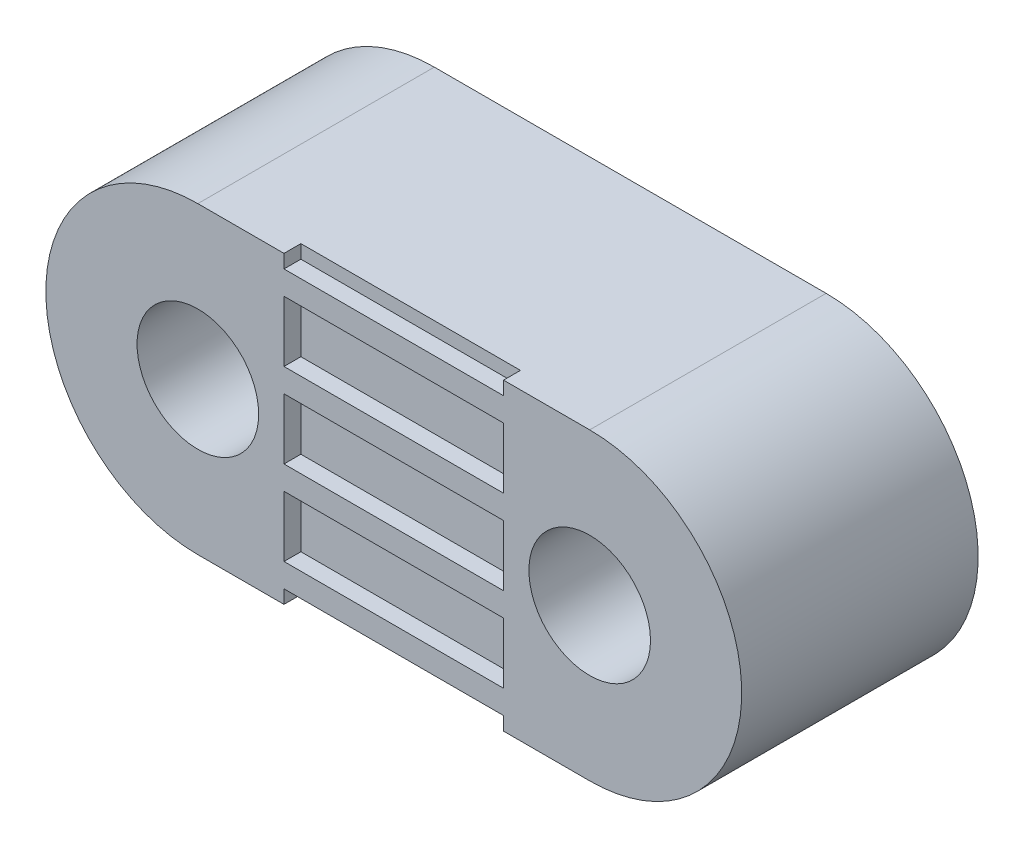
ISO-10303-21;
HEADER;
FILE_DESCRIPTION(('STEP AP214'),'2;1');
FILE_NAME('part.step','',(''),(''),'','','');
FILE_SCHEMA(('AUTOMOTIVE_DESIGN { 1 0 10303 214 1 1 1 1 }'));
ENDSEC;
DATA;
#1=APPLICATION_CONTEXT('core data for automotive mechanical design processes');
#2=APPLICATION_PROTOCOL_DEFINITION('international standard','automotive_design',2000,#1);
#3=PRODUCT_CONTEXT('',#1,'mechanical');
#4=PRODUCT('Part','Part','',(#3));
#5=PRODUCT_RELATED_PRODUCT_CATEGORY('part','',(#4));
#6=PRODUCT_DEFINITION_FORMATION('','',#4);
#7=PRODUCT_DEFINITION_CONTEXT('part definition',#1,'design');
#8=PRODUCT_DEFINITION('design','',#6,#7);
#9=PRODUCT_DEFINITION_SHAPE('','',#8);
#10=(LENGTH_UNIT() NAMED_UNIT(*) SI_UNIT(.MILLI.,.METRE.));
#11=(NAMED_UNIT(*) PLANE_ANGLE_UNIT() SI_UNIT($,.RADIAN.));
#12=(NAMED_UNIT(*) SI_UNIT($,.STERADIAN.) SOLID_ANGLE_UNIT());
#13=UNCERTAINTY_MEASURE_WITH_UNIT(LENGTH_MEASURE(1.E-05),#10,'distance_accuracy_value','');
#14=(GEOMETRIC_REPRESENTATION_CONTEXT(3) GLOBAL_UNCERTAINTY_ASSIGNED_CONTEXT((#13)) GLOBAL_UNIT_ASSIGNED_CONTEXT((#10,
#11,#12)) REPRESENTATION_CONTEXT('',''));
#15=CARTESIAN_POINT('',(0.,0.,0.));
#16=DIRECTION('',(0.,0.,1.));
#17=DIRECTION('',(1.,0.,0.));
#18=AXIS2_PLACEMENT_3D('',#15,#16,#17);
#19=CARTESIAN_POINT('',(9.,-0.500000000000001,-7.));
#20=DIRECTION('',(0.,0.,1.));
#21=DIRECTION('',(1.,0.,0.));
#22=AXIS2_PLACEMENT_3D('',#19,#20,#21);
#23=CYLINDRICAL_SURFACE('',#22,4.5);
#24=CARTESIAN_POINT('',(9.,-0.500000000000001,0.));
#25=DIRECTION('',(0.,0.,1.));
#26=DIRECTION('',(1.,0.,0.));
#27=AXIS2_PLACEMENT_3D('',#24,#25,#26);
#28=CIRCLE('',#27,4.5);
#29=CARTESIAN_POINT('',(9.,-5.,0.));
#30=VERTEX_POINT('',#29);
#31=CARTESIAN_POINT('',(9.,4.,0.));
#32=VERTEX_POINT('',#31);
#33=EDGE_CURVE('E349',#30,#32,#28,.T.);
#34=ORIENTED_EDGE('',*,*,#33,.F.);
#35=DIRECTION('',(0.,0.,1.));
#36=VECTOR('',#35,1.);
#37=CARTESIAN_POINT('',(9.,-5.,-7.));
#38=LINE('',#37,#36);
#39=CARTESIAN_POINT('',(9.,-5.,-7.));
#40=VERTEX_POINT('',#39);
#41=EDGE_CURVE('E378',#40,#30,#38,.T.);
#42=ORIENTED_EDGE('',*,*,#41,.F.);
#43=CARTESIAN_POINT('',(9.,-0.500000000000001,-7.));
#44=DIRECTION('',(0.,0.,1.));
#45=DIRECTION('',(1.,0.,0.));
#46=AXIS2_PLACEMENT_3D('',#43,#44,#45);
#47=CIRCLE('',#46,4.5);
#48=CARTESIAN_POINT('',(9.,4.,-7.));
#49=VERTEX_POINT('',#48);
#50=EDGE_CURVE('E352',#40,#49,#47,.T.);
#51=ORIENTED_EDGE('',*,*,#50,.T.);
#52=DIRECTION('',(0.,0.,1.));
#53=VECTOR('',#52,1.);
#54=CARTESIAN_POINT('',(9.,4.,-7.));
#55=LINE('',#54,#53);
#56=EDGE_CURVE('E365',#49,#32,#55,.T.);
#57=ORIENTED_EDGE('',*,*,#56,.T.);
#58=EDGE_LOOP('',(#34,#42,#51,#57));
#59=FACE_BOUND('',#58,.T.);
#60=ADVANCED_FACE('F34',(#59),#23,.T.);
#61=CARTESIAN_POINT('',(-2.6,-5.,-7.));
#62=DIRECTION('',(0.,-1.,0.));
#63=DIRECTION('',(0.,0.,-1.));
#64=AXIS2_PLACEMENT_3D('',#61,#62,#63);
#65=PLANE('',#64);
#66=DIRECTION('',(0.,0.,-1.));
#67=VECTOR('',#66,1.);
#68=CARTESIAN_POINT('',(-0.049999865110938,-5.,-7.));
#69=LINE('',#68,#67);
#70=CARTESIAN_POINT('',(-0.0499998651109379,-5.,0.));
#71=VERTEX_POINT('',#70);
#72=CARTESIAN_POINT('',(-0.0499998651109379,-5.,-0.5));
#73=VERTEX_POINT('',#72);
#74=EDGE_CURVE('E337',#71,#73,#69,.T.);
#75=ORIENTED_EDGE('',*,*,#74,.F.);
#76=DIRECTION('',(1.,0.,0.));
#77=VECTOR('',#76,1.);
#78=CARTESIAN_POINT('',(-2.6,-5.,0.));
#79=LINE('',#78,#77);
#80=CARTESIAN_POINT('',(-2.6,-5.,0.));
#81=VERTEX_POINT('',#80);
#82=EDGE_CURVE('E356',#81,#71,#79,.T.);
#83=ORIENTED_EDGE('',*,*,#82,.F.);
#84=DIRECTION('',(0.,0.,1.));
#85=VECTOR('',#84,1.);
#86=CARTESIAN_POINT('',(-2.6,-5.,-7.));
#87=LINE('',#86,#85);
#88=CARTESIAN_POINT('',(-2.6,-5.,-7.));
#89=VERTEX_POINT('',#88);
#90=EDGE_CURVE('E382',#89,#81,#87,.T.);
#91=ORIENTED_EDGE('',*,*,#90,.F.);
#92=DIRECTION('',(1.,0.,0.));
#93=VECTOR('',#92,1.);
#94=CARTESIAN_POINT('',(-2.6,-5.,-7.));
#95=LINE('',#94,#93);
#96=EDGE_CURVE('E362',#89,#40,#95,.T.);
#97=ORIENTED_EDGE('',*,*,#96,.T.);
#98=ORIENTED_EDGE('',*,*,#41,.T.);
#99=CARTESIAN_POINT('',(6.45000013488906,-5.,0.));
#100=VERTEX_POINT('',#99);
#101=EDGE_CURVE('E375',#100,#30,#79,.T.);
#102=ORIENTED_EDGE('',*,*,#101,.F.);
#103=DIRECTION('',(0.,0.,1.));
#104=VECTOR('',#103,1.);
#105=CARTESIAN_POINT('',(6.45000013488906,-5.,-7.));
#106=LINE('',#105,#104);
#107=CARTESIAN_POINT('',(6.45000013488906,-5.,-0.5));
#108=VERTEX_POINT('',#107);
#109=EDGE_CURVE('E333',#108,#100,#106,.T.);
#110=ORIENTED_EDGE('',*,*,#109,.F.);
#111=DIRECTION('',(-1.,0.,0.));
#112=VECTOR('',#111,1.);
#113=CARTESIAN_POINT('',(-2.6,-5.,-0.5));
#114=LINE('',#113,#112);
#115=EDGE_CURVE('E389',#108,#73,#114,.T.);
#116=ORIENTED_EDGE('',*,*,#115,.T.);
#117=EDGE_LOOP('',(#75,#83,#91,#97,#98,#102,#110,#116));
#118=FACE_BOUND('',#117,.T.);
#119=ADVANCED_FACE('F394',(#118),#65,.T.);
#120=CARTESIAN_POINT('',(-2.6,-0.500000000000001,-7.));
#121=DIRECTION('',(0.,0.,1.));
#122=DIRECTION('',(1.,0.,0.));
#123=AXIS2_PLACEMENT_3D('',#120,#121,#122);
#124=CYLINDRICAL_SURFACE('',#123,4.5);
#125=CARTESIAN_POINT('',(-2.6,-0.500000000000001,0.));
#126=DIRECTION('',(0.,0.,1.));
#127=DIRECTION('',(1.,0.,0.));
#128=AXIS2_PLACEMENT_3D('',#125,#126,#127);
#129=CIRCLE('',#128,4.5);
#130=CARTESIAN_POINT('',(-2.6,4.,0.));
#131=VERTEX_POINT('',#130);
#132=EDGE_CURVE('E372',#131,#81,#129,.T.);
#133=ORIENTED_EDGE('',*,*,#132,.F.);
#134=DIRECTION('',(0.,0.,1.));
#135=VECTOR('',#134,1.);
#136=CARTESIAN_POINT('',(-2.6,4.,-7.));
#137=LINE('',#136,#135);
#138=CARTESIAN_POINT('',(-2.6,4.,-7.));
#139=VERTEX_POINT('',#138);
#140=EDGE_CURVE('E384',#139,#131,#137,.T.);
#141=ORIENTED_EDGE('',*,*,#140,.F.);
#142=CARTESIAN_POINT('',(-2.6,-0.500000000000001,-7.));
#143=DIRECTION('',(0.,0.,1.));
#144=DIRECTION('',(1.,0.,0.));
#145=AXIS2_PLACEMENT_3D('',#142,#143,#144);
#146=CIRCLE('',#145,4.5);
#147=EDGE_CURVE('E359',#139,#89,#146,.T.);
#148=ORIENTED_EDGE('',*,*,#147,.T.);
#149=ORIENTED_EDGE('',*,*,#90,.T.);
#150=EDGE_LOOP('',(#133,#141,#148,#149));
#151=FACE_BOUND('',#150,.T.);
#152=ADVANCED_FACE('F419',(#151),#124,.T.);
#153=CARTESIAN_POINT('',(9.,4.,-7.));
#154=DIRECTION('',(0.,1.,0.));
#155=DIRECTION('',(-1.,0.,0.));
#156=AXIS2_PLACEMENT_3D('',#153,#154,#155);
#157=PLANE('',#156);
#158=DIRECTION('',(0.,0.,1.));
#159=VECTOR('',#158,1.);
#160=CARTESIAN_POINT('',(-0.0499998651109362,4.,-7.));
#161=LINE('',#160,#159);
#162=CARTESIAN_POINT('',(-0.0499998651109373,4.,-0.5));
#163=VERTEX_POINT('',#162);
#164=CARTESIAN_POINT('',(-0.0499998651109373,4.,0.));
#165=VERTEX_POINT('',#164);
#166=EDGE_CURVE('E221',#163,#165,#161,.T.);
#167=ORIENTED_EDGE('',*,*,#166,.F.);
#168=DIRECTION('',(1.,0.,0.));
#169=VECTOR('',#168,1.);
#170=CARTESIAN_POINT('',(9.,4.,-0.5));
#171=LINE('',#170,#169);
#172=CARTESIAN_POINT('',(6.45000013488906,4.,-0.5));
#173=VERTEX_POINT('',#172);
#174=EDGE_CURVE('E11',#163,#173,#171,.T.);
#175=ORIENTED_EDGE('',*,*,#174,.T.);
#176=DIRECTION('',(0.,0.,-1.));
#177=VECTOR('',#176,1.);
#178=CARTESIAN_POINT('',(6.45000013488906,4.,-7.));
#179=LINE('',#178,#177);
#180=CARTESIAN_POINT('',(6.45000013488906,4.,0.));
#181=VERTEX_POINT('',#180);
#182=EDGE_CURVE('E218',#181,#173,#179,.T.);
#183=ORIENTED_EDGE('',*,*,#182,.F.);
#184=DIRECTION('',(-1.,0.,0.));
#185=VECTOR('',#184,1.);
#186=CARTESIAN_POINT('',(9.,4.,0.));
#187=LINE('',#186,#185);
#188=EDGE_CURVE('E369',#32,#181,#187,.T.);
#189=ORIENTED_EDGE('',*,*,#188,.F.);
#190=ORIENTED_EDGE('',*,*,#56,.F.);
#191=DIRECTION('',(-1.,0.,0.));
#192=VECTOR('',#191,1.);
#193=CARTESIAN_POINT('',(9.,4.,-7.));
#194=LINE('',#193,#192);
#195=EDGE_CURVE('E355',#49,#139,#194,.T.);
#196=ORIENTED_EDGE('',*,*,#195,.T.);
#197=ORIENTED_EDGE('',*,*,#140,.T.);
#198=EDGE_CURVE('E368',#165,#131,#187,.T.);
#199=ORIENTED_EDGE('',*,*,#198,.F.);
#200=EDGE_LOOP('',(#167,#175,#183,#189,#190,#196,#197,#199));
#201=FACE_BOUND('',#200,.T.);
#202=ADVANCED_FACE('F430',(#201),#157,.T.);
#203=CARTESIAN_POINT('',(9.,-0.500000000000001,-7.));
#204=DIRECTION('',(0.,0.,1.));
#205=DIRECTION('',(1.,0.,0.));
#206=AXIS2_PLACEMENT_3D('',#203,#204,#205);
#207=PLANE('',#206);
#208=CARTESIAN_POINT('',(-2.6,-0.500000000000001,-7.));
#209=DIRECTION('',(0.,0.,1.));
#210=DIRECTION('',(1.,0.,0.));
#211=AXIS2_PLACEMENT_3D('',#208,#209,#210);
#212=CIRCLE('',#211,1.8);
#213=CARTESIAN_POINT('',(-0.799999999999995,-0.500000000000001,-7.));
#214=VERTEX_POINT('',#213);
#215=EDGE_CURVE('E340',#214,#214,#212,.T.);
#216=ORIENTED_EDGE('',*,*,#215,.T.);
#217=EDGE_LOOP('',(#216));
#218=FACE_BOUND('',#217,.T.);
#219=CARTESIAN_POINT('',(9.,-0.500000000000001,-7.));
#220=DIRECTION('',(0.,0.,1.));
#221=DIRECTION('',(1.,0.,0.));
#222=AXIS2_PLACEMENT_3D('',#219,#220,#221);
#223=CIRCLE('',#222,1.79999986511117);
#224=CARTESIAN_POINT('',(10.7999998651112,-0.500000000000001,-7.));
#225=VERTEX_POINT('',#224);
#226=EDGE_CURVE('E346',#225,#225,#223,.T.);
#227=ORIENTED_EDGE('',*,*,#226,.T.);
#228=EDGE_LOOP('',(#227));
#229=FACE_BOUND('',#228,.T.);
#230=ORIENTED_EDGE('',*,*,#50,.F.);
#231=ORIENTED_EDGE('',*,*,#96,.F.);
#232=ORIENTED_EDGE('',*,*,#147,.F.);
#233=ORIENTED_EDGE('',*,*,#195,.F.);
#234=EDGE_LOOP('',(#230,#231,#232,#233));
#235=FACE_BOUND('',#234,.T.);
#236=ADVANCED_FACE('F423',(#218,#229,#235),#207,.F.);
#237=CARTESIAN_POINT('',(9.,-0.500000000000001,0.));
#238=DIRECTION('',(0.,0.,1.));
#239=DIRECTION('',(1.,0.,0.));
#240=AXIS2_PLACEMENT_3D('',#237,#238,#239);
#241=PLANE('',#240);
#242=DIRECTION('',(0.,-1.,0.));
#243=VECTOR('',#242,1.);
#244=CARTESIAN_POINT('',(-0.0499998651109449,-0.499999999999986,0.));
#245=LINE('',#244,#243);
#246=CARTESIAN_POINT('',(-0.049999865110938,3.59999999999998,0.));
#247=VERTEX_POINT('',#246);
#248=EDGE_CURVE('E41',#165,#247,#245,.T.);
#249=ORIENTED_EDGE('',*,*,#248,.F.);
#250=ORIENTED_EDGE('',*,*,#198,.T.);
#251=ORIENTED_EDGE('',*,*,#132,.T.);
#252=ORIENTED_EDGE('',*,*,#82,.T.);
#253=DIRECTION('',(0.,-1.,0.));
#254=VECTOR('',#253,1.);
#255=CARTESIAN_POINT('',(-0.0499998651109379,-4.59999999999999,0.));
#256=LINE('',#255,#254);
#257=CARTESIAN_POINT('',(-0.0499998651109379,-4.59999999999999,0.));
#258=VERTEX_POINT('',#257);
#259=EDGE_CURVE('E311',#258,#71,#256,.T.);
#260=ORIENTED_EDGE('',*,*,#259,.F.);
#261=DIRECTION('',(-1.,0.,0.));
#262=VECTOR('',#261,1.);
#263=CARTESIAN_POINT('',(6.45000013488906,-4.59999999999999,0.));
#264=LINE('',#263,#262);
#265=CARTESIAN_POINT('',(6.45000013488906,-4.59999999999999,0.));
#266=VERTEX_POINT('',#265);
#267=EDGE_CURVE('E322',#266,#258,#264,.T.);
#268=ORIENTED_EDGE('',*,*,#267,.F.);
#269=DIRECTION('',(0.,1.,0.));
#270=VECTOR('',#269,1.);
#271=CARTESIAN_POINT('',(6.45000013488907,-0.499999999999999,0.));
#272=LINE('',#271,#270);
#273=EDGE_CURVE('E381',#100,#266,#272,.T.);
#274=ORIENTED_EDGE('',*,*,#273,.F.);
#275=ORIENTED_EDGE('',*,*,#101,.T.);
#276=ORIENTED_EDGE('',*,*,#33,.T.);
#277=ORIENTED_EDGE('',*,*,#188,.T.);
#278=DIRECTION('',(0.,1.,0.));
#279=VECTOR('',#278,1.);
#280=CARTESIAN_POINT('',(6.45000013488906,3.6,0.));
#281=LINE('',#280,#279);
#282=CARTESIAN_POINT('',(6.45000013488906,3.6,0.));
#283=VERTEX_POINT('',#282);
#284=EDGE_CURVE('E202',#283,#181,#281,.T.);
#285=ORIENTED_EDGE('',*,*,#284,.F.);
#286=DIRECTION('',(1.,0.,0.));
#287=VECTOR('',#286,1.);
#288=CARTESIAN_POINT('',(-0.049999865110938,3.59999999999998,0.));
#289=LINE('',#288,#287);
#290=EDGE_CURVE('E215',#247,#283,#289,.T.);
#291=ORIENTED_EDGE('',*,*,#290,.F.);
#292=EDGE_LOOP('',(#249,#250,#251,#252,#260,#268,#274,#275,#276,#277,#285,#291));
#293=FACE_BOUND('',#292,.T.);
#294=DIRECTION('',(1.,0.,0.));
#295=VECTOR('',#294,1.);
#296=CARTESIAN_POINT('',(-0.0499998651109376,1.10000000000001,0.));
#297=LINE('',#296,#295);
#298=CARTESIAN_POINT('',(-0.0499998651109376,1.10000000000001,0.));
#299=VERTEX_POINT('',#298);
#300=CARTESIAN_POINT('',(6.45000013488906,1.1,0.));
#301=VERTEX_POINT('',#300);
#302=EDGE_CURVE('E56',#299,#301,#297,.T.);
#303=ORIENTED_EDGE('',*,*,#302,.F.);
#304=DIRECTION('',(0.,-1.,0.));
#305=VECTOR('',#304,1.);
#306=CARTESIAN_POINT('',(-0.0499998651109369,2.9,0.));
#307=LINE('',#306,#305);
#308=CARTESIAN_POINT('',(-0.0499998651109369,2.9,0.));
#309=VERTEX_POINT('',#308);
#310=EDGE_CURVE('E227',#309,#299,#307,.T.);
#311=ORIENTED_EDGE('',*,*,#310,.F.);
#312=DIRECTION('',(-1.,0.,0.));
#313=VECTOR('',#312,1.);
#314=CARTESIAN_POINT('',(6.45000013488906,2.90000000000001,0.));
#315=LINE('',#314,#313);
#316=CARTESIAN_POINT('',(6.45000013488906,2.90000000000001,0.));
#317=VERTEX_POINT('',#316);
#318=EDGE_CURVE('E241',#317,#309,#315,.T.);
#319=ORIENTED_EDGE('',*,*,#318,.F.);
#320=DIRECTION('',(0.,1.,0.));
#321=VECTOR('',#320,1.);
#322=CARTESIAN_POINT('',(6.45000013488906,1.1,0.));
#323=LINE('',#322,#321);
#324=EDGE_CURVE('E238',#301,#317,#323,.T.);
#325=ORIENTED_EDGE('',*,*,#324,.F.);
#326=EDGE_LOOP('',(#303,#311,#319,#325));
#327=FACE_BOUND('',#326,.T.);
#328=DIRECTION('',(1.,0.,0.));
#329=VECTOR('',#328,1.);
#330=CARTESIAN_POINT('',(-0.0499998651109376,-1.39999999999999,0.));
#331=LINE('',#330,#329);
#332=CARTESIAN_POINT('',(-0.0499998651109376,-1.39999999999999,0.));
#333=VERTEX_POINT('',#332);
#334=CARTESIAN_POINT('',(6.45000013488906,-1.4,0.));
#335=VERTEX_POINT('',#334);
#336=EDGE_CURVE('E248',#333,#335,#331,.T.);
#337=ORIENTED_EDGE('',*,*,#336,.F.);
#338=DIRECTION('',(0.,-1.,0.));
#339=VECTOR('',#338,1.);
#340=CARTESIAN_POINT('',(-0.049999865110937,0.399999999999995,0.));
#341=LINE('',#340,#339);
#342=CARTESIAN_POINT('',(-0.049999865110937,0.399999999999995,0.));
#343=VERTEX_POINT('',#342);
#344=EDGE_CURVE('E258',#343,#333,#341,.T.);
#345=ORIENTED_EDGE('',*,*,#344,.F.);
#346=DIRECTION('',(-1.,0.,0.));
#347=VECTOR('',#346,1.);
#348=CARTESIAN_POINT('',(6.45000013488906,0.400000000000008,0.));
#349=LINE('',#348,#347);
#350=CARTESIAN_POINT('',(6.45000013488906,0.400000000000008,0.));
#351=VERTEX_POINT('',#350);
#352=EDGE_CURVE('E272',#351,#343,#349,.T.);
#353=ORIENTED_EDGE('',*,*,#352,.F.);
#354=DIRECTION('',(0.,1.,0.));
#355=VECTOR('',#354,1.);
#356=CARTESIAN_POINT('',(6.45000013488906,-1.4,0.));
#357=LINE('',#356,#355);
#358=EDGE_CURVE('E269',#335,#351,#357,.T.);
#359=ORIENTED_EDGE('',*,*,#358,.F.);
#360=EDGE_LOOP('',(#337,#345,#353,#359));
#361=FACE_BOUND('',#360,.T.);
#362=DIRECTION('',(1.,0.,0.));
#363=VECTOR('',#362,1.);
#364=CARTESIAN_POINT('',(-0.0499998651109379,-3.89999999999999,0.));
#365=LINE('',#364,#363);
#366=CARTESIAN_POINT('',(-0.0499998651109379,-3.89999999999999,0.));
#367=VERTEX_POINT('',#366);
#368=CARTESIAN_POINT('',(6.45000013488906,-3.89999999999999,0.));
#369=VERTEX_POINT('',#368);
#370=EDGE_CURVE('E279',#367,#369,#365,.T.);
#371=ORIENTED_EDGE('',*,*,#370,.F.);
#372=DIRECTION('',(0.,-1.,0.));
#373=VECTOR('',#372,1.);
#374=CARTESIAN_POINT('',(-0.0499998651109379,-2.09999999999999,0.));
#375=LINE('',#374,#373);
#376=CARTESIAN_POINT('',(-0.0499998651109379,-2.09999999999999,0.));
#377=VERTEX_POINT('',#376);
#378=EDGE_CURVE('E290',#377,#367,#375,.T.);
#379=ORIENTED_EDGE('',*,*,#378,.F.);
#380=DIRECTION('',(-1.,0.,0.));
#381=VECTOR('',#380,1.);
#382=CARTESIAN_POINT('',(6.45000013488906,-2.09999999999999,0.));
#383=LINE('',#382,#381);
#384=CARTESIAN_POINT('',(6.45000013488906,-2.09999999999999,0.));
#385=VERTEX_POINT('',#384);
#386=EDGE_CURVE('E304',#385,#377,#383,.T.);
#387=ORIENTED_EDGE('',*,*,#386,.F.);
#388=DIRECTION('',(0.,1.,0.));
#389=VECTOR('',#388,1.);
#390=CARTESIAN_POINT('',(6.45000013488906,-3.89999999999999,0.));
#391=LINE('',#390,#389);
#392=EDGE_CURVE('E301',#369,#385,#391,.T.);
#393=ORIENTED_EDGE('',*,*,#392,.F.);
#394=EDGE_LOOP('',(#371,#379,#387,#393));
#395=FACE_BOUND('',#394,.T.);
#396=CARTESIAN_POINT('',(-2.6,-0.500000000000001,0.));
#397=DIRECTION('',(0.,0.,1.));
#398=DIRECTION('',(1.,0.,0.));
#399=AXIS2_PLACEMENT_3D('',#396,#397,#398);
#400=CIRCLE('',#399,1.8);
#401=CARTESIAN_POINT('',(-0.799999999999995,-0.500000000000001,0.));
#402=VERTEX_POINT('',#401);
#403=EDGE_CURVE('E339',#402,#402,#400,.T.);
#404=ORIENTED_EDGE('',*,*,#403,.F.);
#405=EDGE_LOOP('',(#404));
#406=FACE_BOUND('',#405,.T.);
#407=CARTESIAN_POINT('',(9.,-0.500000000000001,0.));
#408=DIRECTION('',(0.,0.,1.));
#409=DIRECTION('',(1.,0.,0.));
#410=AXIS2_PLACEMENT_3D('',#407,#408,#409);
#411=CIRCLE('',#410,1.79999986511117);
#412=CARTESIAN_POINT('',(10.7999998651112,-0.500000000000001,0.));
#413=VERTEX_POINT('',#412);
#414=EDGE_CURVE('E343',#413,#413,#411,.T.);
#415=ORIENTED_EDGE('',*,*,#414,.F.);
#416=EDGE_LOOP('',(#415));
#417=FACE_BOUND('',#416,.T.);
#418=ADVANCED_FACE('F413',(#293,#327,#361,#395,#406,#417),#241,.T.);
#419=CARTESIAN_POINT('',(9.,-0.500000000000001,-7.));
#420=DIRECTION('',(0.,0.,1.));
#421=DIRECTION('',(1.,0.,0.));
#422=AXIS2_PLACEMENT_3D('',#419,#420,#421);
#423=CYLINDRICAL_SURFACE('',#422,1.79999986511117);
#424=ORIENTED_EDGE('',*,*,#226,.F.);
#425=EDGE_LOOP('',(#424));
#426=FACE_BOUND('',#425,.T.);
#427=ORIENTED_EDGE('',*,*,#414,.T.);
#428=EDGE_LOOP('',(#427));
#429=FACE_BOUND('',#428,.T.);
#430=ADVANCED_FACE('F463',(#426,#429),#423,.F.);
#431=CARTESIAN_POINT('',(-2.6,-0.500000000000001,-7.));
#432=DIRECTION('',(0.,0.,1.));
#433=DIRECTION('',(1.,0.,0.));
#434=AXIS2_PLACEMENT_3D('',#431,#432,#433);
#435=CYLINDRICAL_SURFACE('',#434,1.8);
#436=ORIENTED_EDGE('',*,*,#215,.F.);
#437=EDGE_LOOP('',(#436));
#438=FACE_BOUND('',#437,.T.);
#439=ORIENTED_EDGE('',*,*,#403,.T.);
#440=EDGE_LOOP('',(#439));
#441=FACE_BOUND('',#440,.T.);
#442=ADVANCED_FACE('F468',(#438,#441),#435,.F.);
#443=CARTESIAN_POINT('',(-0.0499998651109379,-4.59999999999999,-0.5));
#444=DIRECTION('',(-1.,0.,0.));
#445=DIRECTION('',(0.,-1.,0.));
#446=AXIS2_PLACEMENT_3D('',#443,#444,#445);
#447=PLANE('',#446);
#448=ORIENTED_EDGE('',*,*,#74,.T.);
#449=DIRECTION('',(0.,-1.,0.));
#450=VECTOR('',#449,1.);
#451=CARTESIAN_POINT('',(-0.0499998651109379,-4.59999999999999,-0.5));
#452=LINE('',#451,#450);
#453=CARTESIAN_POINT('',(-0.0499998651109379,-4.59999999999999,-0.5));
#454=VERTEX_POINT('',#453);
#455=EDGE_CURVE('E318',#454,#73,#452,.T.);
#456=ORIENTED_EDGE('',*,*,#455,.F.);
#457=DIRECTION('',(0.,0.,1.));
#458=VECTOR('',#457,1.);
#459=CARTESIAN_POINT('',(-0.0499998651109379,-4.59999999999999,-0.5));
#460=LINE('',#459,#458);
#461=EDGE_CURVE('E331',#454,#258,#460,.T.);
#462=ORIENTED_EDGE('',*,*,#461,.T.);
#463=ORIENTED_EDGE('',*,*,#259,.T.);
#464=EDGE_LOOP('',(#448,#456,#462,#463));
#465=FACE_BOUND('',#464,.T.);
#466=ADVANCED_FACE('F411',(#465),#447,.F.);
#467=CARTESIAN_POINT('',(6.45000013488906,-4.59999999999999,-0.5));
#468=DIRECTION('',(0.,1.,0.));
#469=DIRECTION('',(0.,0.,1.));
#470=AXIS2_PLACEMENT_3D('',#467,#468,#469);
#471=PLANE('',#470);
#472=ORIENTED_EDGE('',*,*,#267,.T.);
#473=ORIENTED_EDGE('',*,*,#461,.F.);
#474=DIRECTION('',(-1.,0.,0.));
#475=VECTOR('',#474,1.);
#476=CARTESIAN_POINT('',(6.45000013488906,-4.59999999999999,-0.5));
#477=LINE('',#476,#475);
#478=CARTESIAN_POINT('',(6.45000013488906,-4.59999999999999,-0.5));
#479=VERTEX_POINT('',#478);
#480=EDGE_CURVE('E324',#479,#454,#477,.T.);
#481=ORIENTED_EDGE('',*,*,#480,.F.);
#482=DIRECTION('',(0.,0.,1.));
#483=VECTOR('',#482,1.);
#484=CARTESIAN_POINT('',(6.45000013488906,-4.59999999999999,-0.5));
#485=LINE('',#484,#483);
#486=EDGE_CURVE('E327',#479,#266,#485,.T.);
#487=ORIENTED_EDGE('',*,*,#486,.T.);
#488=EDGE_LOOP('',(#472,#473,#481,#487));
#489=FACE_BOUND('',#488,.T.);
#490=ADVANCED_FACE('F408',(#489),#471,.F.);
#491=CARTESIAN_POINT('',(6.45000013488906,-5.5,-0.5));
#492=DIRECTION('',(1.,0.,0.));
#493=DIRECTION('',(0.,1.,0.));
#494=AXIS2_PLACEMENT_3D('',#491,#492,#493);
#495=PLANE('',#494);
#496=ORIENTED_EDGE('',*,*,#109,.T.);
#497=ORIENTED_EDGE('',*,*,#273,.T.);
#498=ORIENTED_EDGE('',*,*,#486,.F.);
#499=DIRECTION('',(0.,1.,0.));
#500=VECTOR('',#499,1.);
#501=CARTESIAN_POINT('',(6.45000013488906,-5.5,-0.5));
#502=LINE('',#501,#500);
#503=EDGE_CURVE('E321',#108,#479,#502,.T.);
#504=ORIENTED_EDGE('',*,*,#503,.F.);
#505=EDGE_LOOP('',(#496,#497,#498,#504));
#506=FACE_BOUND('',#505,.T.);
#507=ADVANCED_FACE('F403',(#506),#495,.F.);
#508=CARTESIAN_POINT('',(0.,0.,-0.5));
#509=DIRECTION('',(0.,0.,1.));
#510=DIRECTION('',(1.,0.,0.));
#511=AXIS2_PLACEMENT_3D('',#508,#509,#510);
#512=PLANE('',#511);
#513=ORIENTED_EDGE('',*,*,#503,.T.);
#514=ORIENTED_EDGE('',*,*,#480,.T.);
#515=ORIENTED_EDGE('',*,*,#455,.T.);
#516=ORIENTED_EDGE('',*,*,#115,.F.);
#517=EDGE_LOOP('',(#513,#514,#515,#516));
#518=FACE_BOUND('',#517,.T.);
#519=ADVANCED_FACE('F399',(#518),#512,.T.);
#520=CARTESIAN_POINT('',(-0.0499998651109379,-3.89999999999999,-0.5));
#521=DIRECTION('',(0.,-1.,0.));
#522=DIRECTION('',(1.,0.,0.));
#523=AXIS2_PLACEMENT_3D('',#520,#521,#522);
#524=PLANE('',#523);
#525=ORIENTED_EDGE('',*,*,#370,.T.);
#526=DIRECTION('',(0.,0.,1.));
#527=VECTOR('',#526,1.);
#528=CARTESIAN_POINT('',(6.45000013488906,-3.89999999999999,-0.5));
#529=LINE('',#528,#527);
#530=CARTESIAN_POINT('',(6.45000013488906,-3.89999999999999,-0.5));
#531=VERTEX_POINT('',#530);
#532=EDGE_CURVE('E299',#531,#369,#529,.T.);
#533=ORIENTED_EDGE('',*,*,#532,.F.);
#534=DIRECTION('',(1.,0.,0.));
#535=VECTOR('',#534,1.);
#536=CARTESIAN_POINT('',(-0.0499998651109379,-3.89999999999999,-0.5));
#537=LINE('',#536,#535);
#538=CARTESIAN_POINT('',(-0.0499998651109379,-3.89999999999999,-0.5));
#539=VERTEX_POINT('',#538);
#540=EDGE_CURVE('E286',#539,#531,#537,.T.);
#541=ORIENTED_EDGE('',*,*,#540,.F.);
#542=DIRECTION('',(0.,0.,1.));
#543=VECTOR('',#542,1.);
#544=CARTESIAN_POINT('',(-0.0499998651109379,-3.89999999999999,-0.5));
#545=LINE('',#544,#543);
#546=EDGE_CURVE('E309',#539,#367,#545,.T.);
#547=ORIENTED_EDGE('',*,*,#546,.T.);
#548=EDGE_LOOP('',(#525,#533,#541,#547));
#549=FACE_BOUND('',#548,.T.);
#550=ADVANCED_FACE('F481',(#549),#524,.F.);
#551=CARTESIAN_POINT('',(-0.0499998651109379,-2.09999999999999,-0.5));
#552=DIRECTION('',(-1.,0.,0.));
#553=DIRECTION('',(0.,-1.,0.));
#554=AXIS2_PLACEMENT_3D('',#551,#552,#553);
#555=PLANE('',#554);
#556=ORIENTED_EDGE('',*,*,#378,.T.);
#557=ORIENTED_EDGE('',*,*,#546,.F.);
#558=DIRECTION('',(0.,-1.,0.));
#559=VECTOR('',#558,1.);
#560=CARTESIAN_POINT('',(-0.0499998651109379,-2.09999999999999,-0.5));
#561=LINE('',#560,#559);
#562=CARTESIAN_POINT('',(-0.0499998651109379,-2.09999999999999,-0.5));
#563=VERTEX_POINT('',#562);
#564=EDGE_CURVE('E296',#563,#539,#561,.T.);
#565=ORIENTED_EDGE('',*,*,#564,.F.);
#566=DIRECTION('',(0.,0.,1.));
#567=VECTOR('',#566,1.);
#568=CARTESIAN_POINT('',(-0.0499998651109379,-2.09999999999999,-0.5));
#569=LINE('',#568,#567);
#570=EDGE_CURVE('E312',#563,#377,#569,.T.);
#571=ORIENTED_EDGE('',*,*,#570,.T.);
#572=EDGE_LOOP('',(#556,#557,#565,#571));
#573=FACE_BOUND('',#572,.T.);
#574=ADVANCED_FACE('F484',(#573),#555,.F.);
#575=CARTESIAN_POINT('',(6.45000013488906,-2.09999999999999,-0.5));
#576=DIRECTION('',(0.,1.,0.));
#577=DIRECTION('',(0.,0.,1.));
#578=AXIS2_PLACEMENT_3D('',#575,#576,#577);
#579=PLANE('',#578);
#580=ORIENTED_EDGE('',*,*,#386,.T.);
#581=ORIENTED_EDGE('',*,*,#570,.F.);
#582=DIRECTION('',(-1.,0.,0.));
#583=VECTOR('',#582,1.);
#584=CARTESIAN_POINT('',(6.45000013488906,-2.09999999999999,-0.5));
#585=LINE('',#584,#583);
#586=CARTESIAN_POINT('',(6.45000013488906,-2.09999999999999,-0.5));
#587=VERTEX_POINT('',#586);
#588=EDGE_CURVE('E293',#587,#563,#585,.T.);
#589=ORIENTED_EDGE('',*,*,#588,.F.);
#590=DIRECTION('',(0.,0.,1.));
#591=VECTOR('',#590,1.);
#592=CARTESIAN_POINT('',(6.45000013488906,-2.09999999999999,-0.5));
#593=LINE('',#592,#591);
#594=EDGE_CURVE('E314',#587,#385,#593,.T.);
#595=ORIENTED_EDGE('',*,*,#594,.T.);
#596=EDGE_LOOP('',(#580,#581,#589,#595));
#597=FACE_BOUND('',#596,.T.);
#598=ADVANCED_FACE('F490',(#597),#579,.F.);
#599=CARTESIAN_POINT('',(6.45000013488906,-3.89999999999999,-0.5));
#600=DIRECTION('',(1.,0.,0.));
#601=DIRECTION('',(0.,1.,0.));
#602=AXIS2_PLACEMENT_3D('',#599,#600,#601);
#603=PLANE('',#602);
#604=ORIENTED_EDGE('',*,*,#392,.T.);
#605=ORIENTED_EDGE('',*,*,#594,.F.);
#606=DIRECTION('',(0.,1.,0.));
#607=VECTOR('',#606,1.);
#608=CARTESIAN_POINT('',(6.45000013488906,-3.89999999999999,-0.5));
#609=LINE('',#608,#607);
#610=EDGE_CURVE('E289',#531,#587,#609,.T.);
#611=ORIENTED_EDGE('',*,*,#610,.F.);
#612=ORIENTED_EDGE('',*,*,#532,.T.);
#613=EDGE_LOOP('',(#604,#605,#611,#612));
#614=FACE_BOUND('',#613,.T.);
#615=ADVANCED_FACE('F486',(#614),#603,.F.);
#616=CARTESIAN_POINT('',(0.,0.,-0.5));
#617=DIRECTION('',(0.,0.,1.));
#618=DIRECTION('',(1.,0.,0.));
#619=AXIS2_PLACEMENT_3D('',#616,#617,#618);
#620=PLANE('',#619);
#621=ORIENTED_EDGE('',*,*,#540,.T.);
#622=ORIENTED_EDGE('',*,*,#610,.T.);
#623=ORIENTED_EDGE('',*,*,#588,.T.);
#624=ORIENTED_EDGE('',*,*,#564,.T.);
#625=EDGE_LOOP('',(#621,#622,#623,#624));
#626=FACE_BOUND('',#625,.T.);
#627=ADVANCED_FACE('F489',(#626),#620,.T.);
#628=CARTESIAN_POINT('',(-0.0499998651109376,-1.39999999999999,-0.5));
#629=DIRECTION('',(0.,-1.,0.));
#630=DIRECTION('',(1.,0.,0.));
#631=AXIS2_PLACEMENT_3D('',#628,#629,#630);
#632=PLANE('',#631);
#633=ORIENTED_EDGE('',*,*,#336,.T.);
#634=DIRECTION('',(0.,0.,1.));
#635=VECTOR('',#634,1.);
#636=CARTESIAN_POINT('',(6.45000013488906,-1.4,-0.5));
#637=LINE('',#636,#635);
#638=CARTESIAN_POINT('',(6.45000013488906,-1.4,-0.5));
#639=VERTEX_POINT('',#638);
#640=EDGE_CURVE('E267',#639,#335,#637,.T.);
#641=ORIENTED_EDGE('',*,*,#640,.F.);
#642=DIRECTION('',(1.,0.,0.));
#643=VECTOR('',#642,1.);
#644=CARTESIAN_POINT('',(-0.0499998651109376,-1.39999999999999,-0.5));
#645=LINE('',#644,#643);
#646=CARTESIAN_POINT('',(-0.0499998651109376,-1.39999999999999,-0.5));
#647=VERTEX_POINT('',#646);
#648=EDGE_CURVE('E254',#647,#639,#645,.T.);
#649=ORIENTED_EDGE('',*,*,#648,.F.);
#650=DIRECTION('',(0.,0.,1.));
#651=VECTOR('',#650,1.);
#652=CARTESIAN_POINT('',(-0.0499998651109376,-1.39999999999999,-0.5));
#653=LINE('',#652,#651);
#654=EDGE_CURVE('E277',#647,#333,#653,.T.);
#655=ORIENTED_EDGE('',*,*,#654,.T.);
#656=EDGE_LOOP('',(#633,#641,#649,#655));
#657=FACE_BOUND('',#656,.T.);
#658=ADVANCED_FACE('F500',(#657),#632,.F.);
#659=CARTESIAN_POINT('',(-0.049999865110937,0.399999999999995,-0.5));
#660=DIRECTION('',(-1.,0.,0.));
#661=DIRECTION('',(0.,-1.,0.));
#662=AXIS2_PLACEMENT_3D('',#659,#660,#661);
#663=PLANE('',#662);
#664=ORIENTED_EDGE('',*,*,#344,.T.);
#665=ORIENTED_EDGE('',*,*,#654,.F.);
#666=DIRECTION('',(0.,-1.,0.));
#667=VECTOR('',#666,1.);
#668=CARTESIAN_POINT('',(-0.049999865110937,0.399999999999995,-0.5));
#669=LINE('',#668,#667);
#670=CARTESIAN_POINT('',(-0.049999865110937,0.399999999999995,-0.5));
#671=VERTEX_POINT('',#670);
#672=EDGE_CURVE('E264',#671,#647,#669,.T.);
#673=ORIENTED_EDGE('',*,*,#672,.F.);
#674=DIRECTION('',(0.,0.,1.));
#675=VECTOR('',#674,1.);
#676=CARTESIAN_POINT('',(-0.049999865110937,0.399999999999995,-0.5));
#677=LINE('',#676,#675);
#678=EDGE_CURVE('E280',#671,#343,#677,.T.);
#679=ORIENTED_EDGE('',*,*,#678,.T.);
#680=EDGE_LOOP('',(#664,#665,#673,#679));
#681=FACE_BOUND('',#680,.T.);
#682=ADVANCED_FACE('F504',(#681),#663,.F.);
#683=CARTESIAN_POINT('',(6.45000013488906,0.400000000000008,-0.5));
#684=DIRECTION('',(0.,1.,0.));
#685=DIRECTION('',(-1.,0.,0.));
#686=AXIS2_PLACEMENT_3D('',#683,#684,#685);
#687=PLANE('',#686);
#688=ORIENTED_EDGE('',*,*,#352,.T.);
#689=ORIENTED_EDGE('',*,*,#678,.F.);
#690=DIRECTION('',(-1.,0.,0.));
#691=VECTOR('',#690,1.);
#692=CARTESIAN_POINT('',(6.45000013488906,0.400000000000008,-0.5));
#693=LINE('',#692,#691);
#694=CARTESIAN_POINT('',(6.45000013488906,0.400000000000008,-0.5));
#695=VERTEX_POINT('',#694);
#696=EDGE_CURVE('E261',#695,#671,#693,.T.);
#697=ORIENTED_EDGE('',*,*,#696,.F.);
#698=DIRECTION('',(0.,0.,1.));
#699=VECTOR('',#698,1.);
#700=CARTESIAN_POINT('',(6.45000013488906,0.400000000000008,-0.5));
#701=LINE('',#700,#699);
#702=EDGE_CURVE('E282',#695,#351,#701,.T.);
#703=ORIENTED_EDGE('',*,*,#702,.T.);
#704=EDGE_LOOP('',(#688,#689,#697,#703));
#705=FACE_BOUND('',#704,.T.);
#706=ADVANCED_FACE('F510',(#705),#687,.F.);
#707=CARTESIAN_POINT('',(6.45000013488906,-1.4,-0.5));
#708=DIRECTION('',(1.,0.,0.));
#709=DIRECTION('',(0.,1.,0.));
#710=AXIS2_PLACEMENT_3D('',#707,#708,#709);
#711=PLANE('',#710);
#712=ORIENTED_EDGE('',*,*,#358,.T.);
#713=ORIENTED_EDGE('',*,*,#702,.F.);
#714=DIRECTION('',(0.,1.,0.));
#715=VECTOR('',#714,1.);
#716=CARTESIAN_POINT('',(6.45000013488906,-1.4,-0.5));
#717=LINE('',#716,#715);
#718=EDGE_CURVE('E257',#639,#695,#717,.T.);
#719=ORIENTED_EDGE('',*,*,#718,.F.);
#720=ORIENTED_EDGE('',*,*,#640,.T.);
#721=EDGE_LOOP('',(#712,#713,#719,#720));
#722=FACE_BOUND('',#721,.T.);
#723=ADVANCED_FACE('F506',(#722),#711,.F.);
#724=CARTESIAN_POINT('',(0.,0.,-0.5));
#725=DIRECTION('',(0.,0.,1.));
#726=DIRECTION('',(1.,0.,0.));
#727=AXIS2_PLACEMENT_3D('',#724,#725,#726);
#728=PLANE('',#727);
#729=ORIENTED_EDGE('',*,*,#648,.T.);
#730=ORIENTED_EDGE('',*,*,#718,.T.);
#731=ORIENTED_EDGE('',*,*,#696,.T.);
#732=ORIENTED_EDGE('',*,*,#672,.T.);
#733=EDGE_LOOP('',(#729,#730,#731,#732));
#734=FACE_BOUND('',#733,.T.);
#735=ADVANCED_FACE('F509',(#734),#728,.T.);
#736=CARTESIAN_POINT('',(-0.0499998651109376,1.10000000000001,-0.5));
#737=DIRECTION('',(0.,-1.,0.));
#738=DIRECTION('',(1.,0.,0.));
#739=AXIS2_PLACEMENT_3D('',#736,#737,#738);
#740=PLANE('',#739);
#741=ORIENTED_EDGE('',*,*,#302,.T.);
#742=DIRECTION('',(0.,0.,1.));
#743=VECTOR('',#742,1.);
#744=CARTESIAN_POINT('',(6.45000013488906,1.1,-0.5));
#745=LINE('',#744,#743);
#746=CARTESIAN_POINT('',(6.45000013488906,1.1,-0.5));
#747=VERTEX_POINT('',#746);
#748=EDGE_CURVE('E236',#747,#301,#745,.T.);
#749=ORIENTED_EDGE('',*,*,#748,.F.);
#750=DIRECTION('',(1.,0.,0.));
#751=VECTOR('',#750,1.);
#752=CARTESIAN_POINT('',(-0.0499998651109376,1.10000000000001,-0.5));
#753=LINE('',#752,#751);
#754=CARTESIAN_POINT('',(-0.0499998651109376,1.10000000000001,-0.5));
#755=VERTEX_POINT('',#754);
#756=EDGE_CURVE('E223',#755,#747,#753,.T.);
#757=ORIENTED_EDGE('',*,*,#756,.F.);
#758=DIRECTION('',(0.,0.,1.));
#759=VECTOR('',#758,1.);
#760=CARTESIAN_POINT('',(-0.0499998651109376,1.10000000000001,-0.5));
#761=LINE('',#760,#759);
#762=EDGE_CURVE('E246',#755,#299,#761,.T.);
#763=ORIENTED_EDGE('',*,*,#762,.T.);
#764=EDGE_LOOP('',(#741,#749,#757,#763));
#765=FACE_BOUND('',#764,.T.);
#766=ADVANCED_FACE('F520',(#765),#740,.F.);
#767=CARTESIAN_POINT('',(-0.0499998651109369,2.9,-0.5));
#768=DIRECTION('',(-1.,0.,0.));
#769=DIRECTION('',(0.,-1.,0.));
#770=AXIS2_PLACEMENT_3D('',#767,#768,#769);
#771=PLANE('',#770);
#772=ORIENTED_EDGE('',*,*,#310,.T.);
#773=ORIENTED_EDGE('',*,*,#762,.F.);
#774=DIRECTION('',(0.,-1.,0.));
#775=VECTOR('',#774,1.);
#776=CARTESIAN_POINT('',(-0.0499998651109369,2.9,-0.5));
#777=LINE('',#776,#775);
#778=CARTESIAN_POINT('',(-0.0499998651109369,2.9,-0.5));
#779=VERTEX_POINT('',#778);
#780=EDGE_CURVE('E233',#779,#755,#777,.T.);
#781=ORIENTED_EDGE('',*,*,#780,.F.);
#782=DIRECTION('',(0.,0.,1.));
#783=VECTOR('',#782,1.);
#784=CARTESIAN_POINT('',(-0.0499998651109369,2.9,-0.5));
#785=LINE('',#784,#783);
#786=EDGE_CURVE('E249',#779,#309,#785,.T.);
#787=ORIENTED_EDGE('',*,*,#786,.T.);
#788=EDGE_LOOP('',(#772,#773,#781,#787));
#789=FACE_BOUND('',#788,.T.);
#790=ADVANCED_FACE('F524',(#789),#771,.F.);
#791=CARTESIAN_POINT('',(6.45000013488906,2.90000000000001,-0.5));
#792=DIRECTION('',(0.,1.,0.));
#793=DIRECTION('',(-1.,0.,0.));
#794=AXIS2_PLACEMENT_3D('',#791,#792,#793);
#795=PLANE('',#794);
#796=ORIENTED_EDGE('',*,*,#318,.T.);
#797=ORIENTED_EDGE('',*,*,#786,.F.);
#798=DIRECTION('',(-1.,0.,0.));
#799=VECTOR('',#798,1.);
#800=CARTESIAN_POINT('',(6.45000013488906,2.90000000000001,-0.5));
#801=LINE('',#800,#799);
#802=CARTESIAN_POINT('',(6.45000013488906,2.90000000000001,-0.5));
#803=VERTEX_POINT('',#802);
#804=EDGE_CURVE('E230',#803,#779,#801,.T.);
#805=ORIENTED_EDGE('',*,*,#804,.F.);
#806=DIRECTION('',(0.,0.,1.));
#807=VECTOR('',#806,1.);
#808=CARTESIAN_POINT('',(6.45000013488906,2.90000000000001,-0.5));
#809=LINE('',#808,#807);
#810=EDGE_CURVE('E251',#803,#317,#809,.T.);
#811=ORIENTED_EDGE('',*,*,#810,.T.);
#812=EDGE_LOOP('',(#796,#797,#805,#811));
#813=FACE_BOUND('',#812,.T.);
#814=ADVANCED_FACE('F528',(#813),#795,.F.);
#815=CARTESIAN_POINT('',(6.45000013488906,1.1,-0.5));
#816=DIRECTION('',(1.,0.,0.));
#817=DIRECTION('',(0.,1.,0.));
#818=AXIS2_PLACEMENT_3D('',#815,#816,#817);
#819=PLANE('',#818);
#820=ORIENTED_EDGE('',*,*,#324,.T.);
#821=ORIENTED_EDGE('',*,*,#810,.F.);
#822=DIRECTION('',(0.,1.,0.));
#823=VECTOR('',#822,1.);
#824=CARTESIAN_POINT('',(6.45000013488906,1.1,-0.5));
#825=LINE('',#824,#823);
#826=EDGE_CURVE('E226',#747,#803,#825,.T.);
#827=ORIENTED_EDGE('',*,*,#826,.F.);
#828=ORIENTED_EDGE('',*,*,#748,.T.);
#829=EDGE_LOOP('',(#820,#821,#827,#828));
#830=FACE_BOUND('',#829,.T.);
#831=ADVANCED_FACE('F525',(#830),#819,.F.);
#832=CARTESIAN_POINT('',(0.,0.,-0.5));
#833=DIRECTION('',(0.,0.,1.));
#834=DIRECTION('',(1.,0.,0.));
#835=AXIS2_PLACEMENT_3D('',#832,#833,#834);
#836=PLANE('',#835);
#837=ORIENTED_EDGE('',*,*,#756,.T.);
#838=ORIENTED_EDGE('',*,*,#826,.T.);
#839=ORIENTED_EDGE('',*,*,#804,.T.);
#840=ORIENTED_EDGE('',*,*,#780,.T.);
#841=EDGE_LOOP('',(#837,#838,#839,#840));
#842=FACE_BOUND('',#841,.T.);
#843=ADVANCED_FACE('F441',(#842),#836,.T.);
#844=CARTESIAN_POINT('',(-0.0499998651109364,4.49999999999999,-0.5));
#845=DIRECTION('',(-1.,0.,0.));
#846=DIRECTION('',(0.,-1.,0.));
#847=AXIS2_PLACEMENT_3D('',#844,#845,#846);
#848=PLANE('',#847);
#849=ORIENTED_EDGE('',*,*,#166,.T.);
#850=ORIENTED_EDGE('',*,*,#248,.T.);
#851=DIRECTION('',(0.,0.,1.));
#852=VECTOR('',#851,1.);
#853=CARTESIAN_POINT('',(-0.049999865110938,3.59999999999998,-0.5));
#854=LINE('',#853,#852);
#855=CARTESIAN_POINT('',(-0.049999865110938,3.59999999999998,-0.5));
#856=VERTEX_POINT('',#855);
#857=EDGE_CURVE('E48',#856,#247,#854,.T.);
#858=ORIENTED_EDGE('',*,*,#857,.F.);
#859=DIRECTION('',(0.,-1.,0.));
#860=VECTOR('',#859,1.);
#861=CARTESIAN_POINT('',(-0.0499998651109364,4.49999999999999,-0.5));
#862=LINE('',#861,#860);
#863=EDGE_CURVE('E196',#163,#856,#862,.T.);
#864=ORIENTED_EDGE('',*,*,#863,.F.);
#865=EDGE_LOOP('',(#849,#850,#858,#864));
#866=FACE_BOUND('',#865,.T.);
#867=ADVANCED_FACE('F204',(#866),#848,.F.);
#868=CARTESIAN_POINT('',(6.45000013488906,3.6,-0.5));
#869=DIRECTION('',(1.,0.,0.));
#870=DIRECTION('',(0.,0.,-1.));
#871=AXIS2_PLACEMENT_3D('',#868,#869,#870);
#872=PLANE('',#871);
#873=ORIENTED_EDGE('',*,*,#182,.T.);
#874=DIRECTION('',(0.,1.,0.));
#875=VECTOR('',#874,1.);
#876=CARTESIAN_POINT('',(6.45000013488906,3.6,-0.5));
#877=LINE('',#876,#875);
#878=CARTESIAN_POINT('',(6.45000013488906,3.6,-0.5));
#879=VERTEX_POINT('',#878);
#880=EDGE_CURVE('E208',#879,#173,#877,.T.);
#881=ORIENTED_EDGE('',*,*,#880,.F.);
#882=DIRECTION('',(0.,0.,1.));
#883=VECTOR('',#882,1.);
#884=CARTESIAN_POINT('',(6.45000013488906,3.6,-0.5));
#885=LINE('',#884,#883);
#886=EDGE_CURVE('E207',#879,#283,#885,.T.);
#887=ORIENTED_EDGE('',*,*,#886,.T.);
#888=ORIENTED_EDGE('',*,*,#284,.T.);
#889=EDGE_LOOP('',(#873,#881,#887,#888));
#890=FACE_BOUND('',#889,.T.);
#891=ADVANCED_FACE('F432',(#890),#872,.F.);
#892=CARTESIAN_POINT('',(-0.049999865110938,3.59999999999998,-0.5));
#893=DIRECTION('',(0.,-1.,0.));
#894=DIRECTION('',(1.,0.,0.));
#895=AXIS2_PLACEMENT_3D('',#892,#893,#894);
#896=PLANE('',#895);
#897=ORIENTED_EDGE('',*,*,#290,.T.);
#898=ORIENTED_EDGE('',*,*,#886,.F.);
#899=DIRECTION('',(1.,0.,0.));
#900=VECTOR('',#899,1.);
#901=CARTESIAN_POINT('',(-0.049999865110938,3.59999999999998,-0.5));
#902=LINE('',#901,#900);
#903=EDGE_CURVE('E199',#856,#879,#902,.T.);
#904=ORIENTED_EDGE('',*,*,#903,.F.);
#905=ORIENTED_EDGE('',*,*,#857,.T.);
#906=EDGE_LOOP('',(#897,#898,#904,#905));
#907=FACE_BOUND('',#906,.T.);
#908=ADVANCED_FACE('F210',(#907),#896,.F.);
#909=CARTESIAN_POINT('',(0.,0.,-0.5));
#910=DIRECTION('',(0.,0.,1.));
#911=DIRECTION('',(1.,0.,0.));
#912=AXIS2_PLACEMENT_3D('',#909,#910,#911);
#913=PLANE('',#912);
#914=ORIENTED_EDGE('',*,*,#863,.T.);
#915=ORIENTED_EDGE('',*,*,#903,.T.);
#916=ORIENTED_EDGE('',*,*,#880,.T.);
#917=ORIENTED_EDGE('',*,*,#174,.F.);
#918=EDGE_LOOP('',(#914,#915,#916,#917));
#919=FACE_BOUND('',#918,.T.);
#920=ADVANCED_FACE('F197',(#919),#913,.T.);
#921=CLOSED_SHELL('',(#60,#119,#152,#202,#236,#418,#430,#442,#466,#490,#507,#519,#550,#574,#598,
#615,#627,#658,#682,#706,#723,#735,#766,#790,#814,#831,#843,#867,#891,#908,#920));
#922=MANIFOLD_SOLID_BREP('B2',#921);
#923=ADVANCED_BREP_SHAPE_REPRESENTATION('',(#18,#922),#14);
#924=SHAPE_DEFINITION_REPRESENTATION(#9,#923);
ENDSEC;
END-ISO-10303-21;
